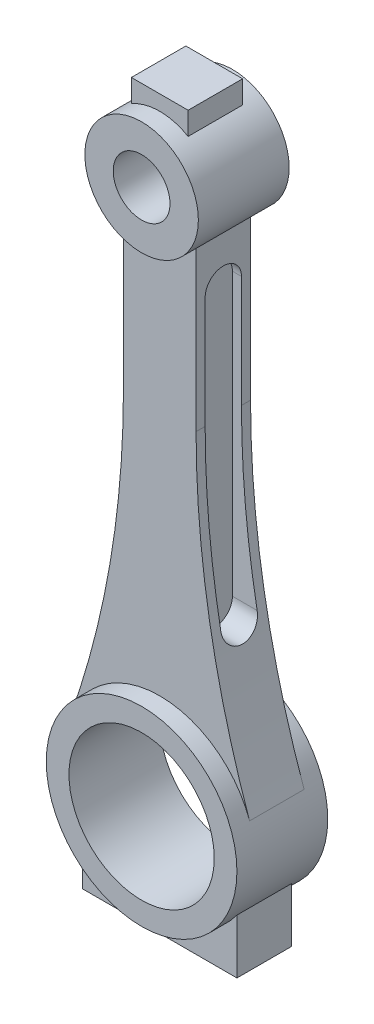
ISO-10303-21;
HEADER;
FILE_DESCRIPTION(('STEP AP214'),'2;1');
FILE_NAME('part.step','',(''),(''),'','','');
FILE_SCHEMA(('AUTOMOTIVE_DESIGN { 1 0 10303 214 1 1 1 1 }'));
ENDSEC;
DATA;
#1=APPLICATION_CONTEXT('core data for automotive mechanical design processes');
#2=APPLICATION_PROTOCOL_DEFINITION('international standard','automotive_design',2000,#1);
#3=PRODUCT_CONTEXT('',#1,'mechanical');
#4=PRODUCT('Part','Part','',(#3));
#5=PRODUCT_RELATED_PRODUCT_CATEGORY('part','',(#4));
#6=PRODUCT_DEFINITION_FORMATION('','',#4);
#7=PRODUCT_DEFINITION_CONTEXT('part definition',#1,'design');
#8=PRODUCT_DEFINITION('design','',#6,#7);
#9=PRODUCT_DEFINITION_SHAPE('','',#8);
#10=(LENGTH_UNIT() NAMED_UNIT(*) SI_UNIT(.MILLI.,.METRE.));
#11=(NAMED_UNIT(*) PLANE_ANGLE_UNIT() SI_UNIT($,.RADIAN.));
#12=(NAMED_UNIT(*) SI_UNIT($,.STERADIAN.) SOLID_ANGLE_UNIT());
#13=UNCERTAINTY_MEASURE_WITH_UNIT(LENGTH_MEASURE(1.E-05),#10,'distance_accuracy_value','');
#14=(GEOMETRIC_REPRESENTATION_CONTEXT(3) GLOBAL_UNCERTAINTY_ASSIGNED_CONTEXT((#13)) GLOBAL_UNIT_ASSIGNED_CONTEXT((#10,
#11,#12)) REPRESENTATION_CONTEXT('',''));
#15=CARTESIAN_POINT('',(0.,0.,0.));
#16=DIRECTION('',(0.,0.,1.));
#17=DIRECTION('',(1.,0.,0.));
#18=AXIS2_PLACEMENT_3D('',#15,#16,#17);
#19=CARTESIAN_POINT('',(212.132819979024,75.3953136438507,6.));
#20=DIRECTION('',(0.,0.,-1.));
#21=DIRECTION('',(-1.,0.,0.));
#22=AXIS2_PLACEMENT_3D('',#19,#20,#21);
#23=CYLINDRICAL_SURFACE('',#22,204.132819979024);
#24=CARTESIAN_POINT('',(11.4544735884215,38.,-4.00000000000001));
#25=CARTESIAN_POINT('',(11.4757515518411,37.8858086335559,-4.00000967356236));
#26=CARTESIAN_POINT('',(11.497127848932,37.7716411229782,-3.9951101211208));
#27=CARTESIAN_POINT('',(11.5399210356049,37.544152772884,-3.97557755361704));
#28=CARTESIAN_POINT('',(11.5613379239584,37.4308319082382,-3.9609448286138));
#29=CARTESIAN_POINT('',(11.6040518019029,37.2058589467753,-3.92203609087538));
#30=CARTESIAN_POINT('',(11.6253488219803,37.0942064124742,-3.89776265395078));
#31=CARTESIAN_POINT('',(11.6676599337569,36.8733657612217,-3.83975872762631));
#32=CARTESIAN_POINT('',(11.6886740293759,36.7641776101131,-3.80602836938937));
#33=CARTESIAN_POINT('',(11.7510730473326,36.4413470108117,-3.69089420326938));
#34=CARTESIAN_POINT('',(11.7918289081029,36.2323636826891,-3.59553432969808));
#35=CARTESIAN_POINT('',(11.8702126062764,35.833491871712,-3.37027556179514));
#36=CARTESIAN_POINT('',(11.9078413597511,35.643597793309,-3.24038682968163));
#37=CARTESIAN_POINT('',(11.9784728244352,35.2894796680367,-2.950436910244));
#38=CARTESIAN_POINT('',(12.0115036519544,35.1250988255321,-2.79057453802655));
#39=CARTESIAN_POINT('',(12.0720036427705,34.8256035029566,-2.44449926104124));
#40=CARTESIAN_POINT('',(12.0994724370193,34.6904909648341,-2.25828460915733));
#41=CARTESIAN_POINT('',(12.1473413477104,34.4559602912754,-1.86832249559897));
#42=CARTESIAN_POINT('',(12.1678582991115,34.3559510460777,-1.66494499104501));
#43=CARTESIAN_POINT('',(12.201667760202,34.1915558050773,-1.24372237948288));
#44=CARTESIAN_POINT('',(12.2149615713728,34.1271633917176,-1.02587988675161));
#45=CARTESIAN_POINT('',(12.2336033492387,34.0369591960168,-0.586274812122707));
#46=CARTESIAN_POINT('',(12.2390950212481,34.0104496060439,-0.364661335561857));
#47=CARTESIAN_POINT('',(12.2423732155318,33.9946184843632,0.0799443502249391));
#48=CARTESIAN_POINT('',(12.2401601145853,34.0052951341723,0.302936491499032));
#49=CARTESIAN_POINT('',(12.2281765408432,34.0632127244266,0.74178192582431));
#50=CARTESIAN_POINT('',(12.2184766498272,34.1101121767816,0.957682365575696));
#51=CARTESIAN_POINT('',(12.1919895794175,34.2385791029979,1.37844153266757));
#52=CARTESIAN_POINT('',(12.1752023313576,34.3201469127454,1.58330015300714));
#53=CARTESIAN_POINT('',(12.1350793834177,34.5159552856904,1.977397761575));
#54=CARTESIAN_POINT('',(12.1117098081663,34.6303649264094,2.16654921549123));
#55=CARTESIAN_POINT('',(12.0593260749273,34.8882465100265,2.52297125984127));
#56=CARTESIAN_POINT('',(12.0303117725959,35.0317191961119,2.69024129055298));
#57=CARTESIAN_POINT('',(11.9671383735568,35.3461665633751,3.00114206510914));
#58=CARTESIAN_POINT('',(11.9329025496515,35.5175545383741,3.14433904981939));
#59=CARTESIAN_POINT('',(11.8607975408037,35.8812712267655,3.40006280722764));
#60=CARTESIAN_POINT('',(11.8229268395298,36.0736086840292,3.51257670427656));
#61=CARTESIAN_POINT('',(11.744011046999,36.4777513253325,3.70593438635491));
#62=CARTESIAN_POINT('',(11.7029182624971,36.6898643551292,3.78611370956408));
#63=CARTESIAN_POINT('',(11.6195357198389,37.1241795414682,3.90944320644274));
#64=CARTESIAN_POINT('',(11.5772477716993,37.3463667203578,3.95264656840454));
#65=CARTESIAN_POINT('',(11.5215540274852,37.6417241762258,3.98457340087694));
#66=CARTESIAN_POINT('',(11.5080944382149,37.713314753212,3.99036111817268));
#67=CARTESIAN_POINT('',(11.4812368188341,37.8565916807733,3.99806924003837));
#68=CARTESIAN_POINT('',(11.467838723541,37.9282776734255,3.99999606757804));
#69=CARTESIAN_POINT('',(11.4544735884215,38.,3.99999999999999));
#70=B_SPLINE_CURVE_WITH_KNOTS('',3,(#24,#25,#26,#27,#28,#29,#30,#31,#32,#33,#34,#35,#36,#37,#38,
#39,#40,#41,#42,#43,#44,#45,#46,#47,#48,#49,#50,#51,#52,#53,#54,#55,#56,#57,#58,#59,#60,#61,#62,
#63,#64,#65,#66,#67,#68,#69),.UNSPECIFIED.,.F.,.F.,(4,2,2,2,2,2,2,2,2,2,2,2,2,2,2,2,2,2,2,2,2,2,
4),(0.,0.348357600629778,0.696704820295753,1.044959030908,1.39320841164154,2.0894785742732,
2.78554404346983,3.47714614167072,4.1687941135383,4.84816302804555,5.52740949173435,
6.19397531687089,6.86050854603355,7.52083364695974,8.18116514562693,8.84495910470898,
9.50877004017901,10.1834922182609,10.8584970981523,11.546741507572,12.2339942357505,
12.4531452672714,12.6719314158043),.UNSPECIFIED.);
#71=CARTESIAN_POINT('',(11.4544735884215,38.,-4.00000000000001));
#72=VERTEX_POINT('',#71);
#73=CARTESIAN_POINT('',(11.4544735884215,38.,3.99999999999999));
#74=VERTEX_POINT('',#73);
#75=EDGE_CURVE('E400',#72,#74,#70,.T.);
#76=ORIENTED_EDGE('',*,*,#75,.T.);
#77=CARTESIAN_POINT('',(212.132819979024,75.3953136438507,4.));
#78=DIRECTION('',(0.,0.,-1.));
#79=DIRECTION('',(0.,1.,0.));
#80=AXIS2_PLACEMENT_3D('',#77,#78,#79);
#81=CIRCLE('',#80,204.132819979024);
#82=CARTESIAN_POINT('',(8.,75.3953136438507,4.));
#83=VERTEX_POINT('',#82);
#84=EDGE_CURVE('E251',#74,#83,#81,.T.);
#85=ORIENTED_EDGE('',*,*,#84,.T.);
#86=DIRECTION('',(0.,0.,-1.));
#87=VECTOR('',#86,1.);
#88=CARTESIAN_POINT('',(8.,75.3953136438507,6.));
#89=LINE('',#88,#87);
#90=CARTESIAN_POINT('',(8.,75.3953136438507,6.));
#91=VERTEX_POINT('',#90);
#92=EDGE_CURVE('E367',#91,#83,#89,.T.);
#93=ORIENTED_EDGE('',*,*,#92,.F.);
#94=CARTESIAN_POINT('',(212.132819979024,75.3953136438507,6.));
#95=DIRECTION('',(0.,0.,1.));
#96=DIRECTION('',(1.,0.,0.));
#97=AXIS2_PLACEMENT_3D('',#94,#95,#96);
#98=CIRCLE('',#97,204.132819979024);
#99=CARTESIAN_POINT('',(19.7873824881444,7.03274443356765,6.));
#100=VERTEX_POINT('',#99);
#101=EDGE_CURVE('E342',#91,#100,#98,.T.);
#102=ORIENTED_EDGE('',*,*,#101,.T.);
#103=DIRECTION('',(0.,0.,-1.));
#104=VECTOR('',#103,1.);
#105=CARTESIAN_POINT('',(19.7873824881444,7.03274443356764,6.));
#106=LINE('',#105,#104);
#107=CARTESIAN_POINT('',(19.7873824881444,7.03274443356765,-6.));
#108=VERTEX_POINT('',#107);
#109=EDGE_CURVE('E370',#100,#108,#106,.T.);
#110=ORIENTED_EDGE('',*,*,#109,.T.);
#111=CARTESIAN_POINT('',(212.132819979024,75.3953136438507,-6.));
#112=DIRECTION('',(0.,0.,1.));
#113=DIRECTION('',(1.,0.,0.));
#114=AXIS2_PLACEMENT_3D('',#111,#112,#113);
#115=CIRCLE('',#114,204.132819979024);
#116=CARTESIAN_POINT('',(8.,75.3953136438507,-6.));
#117=VERTEX_POINT('',#116);
#118=EDGE_CURVE('E360',#117,#108,#115,.T.);
#119=ORIENTED_EDGE('',*,*,#118,.F.);
#120=CARTESIAN_POINT('',(8.,75.3953136438507,-4.));
#121=VERTEX_POINT('',#120);
#122=EDGE_CURVE('E366',#121,#117,#89,.T.);
#123=ORIENTED_EDGE('',*,*,#122,.F.);
#124=CARTESIAN_POINT('',(212.132819979024,75.3953136438507,-4.00000000000001));
#125=DIRECTION('',(0.,0.,1.));
#126=DIRECTION('',(0.,-1.,0.));
#127=AXIS2_PLACEMENT_3D('',#124,#125,#126);
#128=CIRCLE('',#127,204.132819979024);
#129=EDGE_CURVE('E58',#121,#72,#128,.T.);
#130=ORIENTED_EDGE('',*,*,#129,.T.);
#131=EDGE_LOOP('',(#76,#85,#93,#102,#110,#119,#123,#130));
#132=FACE_BOUND('',#131,.T.);
#133=ADVANCED_FACE('F35',(#132),#23,.F.);
#134=CARTESIAN_POINT('',(8.00000000000001,0.,6.));
#135=DIRECTION('',(-1.,0.,0.));
#136=DIRECTION('',(0.,-1.,0.));
#137=AXIS2_PLACEMENT_3D('',#134,#135,#136);
#138=PLANE('',#137);
#139=DIRECTION('',(0.,-1.,0.));
#140=VECTOR('',#139,1.);
#141=CARTESIAN_POINT('',(8.00000000000001,0.,3.99999999999999));
#142=LINE('',#141,#140);
#143=CARTESIAN_POINT('',(8.00000000000001,100.,4.));
#144=VERTEX_POINT('',#143);
#145=EDGE_CURVE('E398',#144,#83,#142,.T.);
#146=ORIENTED_EDGE('',*,*,#145,.F.);
#147=CARTESIAN_POINT('',(8.,100.,0.));
#148=DIRECTION('',(-1.,0.,0.));
#149=DIRECTION('',(0.,-1.,0.));
#150=AXIS2_PLACEMENT_3D('',#147,#148,#149);
#151=CIRCLE('',#150,4.);
#152=CARTESIAN_POINT('',(8.00000000000001,100.,-4.));
#153=VERTEX_POINT('',#152);
#154=EDGE_CURVE('E396',#153,#144,#151,.F.);
#155=ORIENTED_EDGE('',*,*,#154,.F.);
#156=DIRECTION('',(0.,1.,0.));
#157=VECTOR('',#156,1.);
#158=CARTESIAN_POINT('',(8.00000000000001,0.,-4.00000000000001));
#159=LINE('',#158,#157);
#160=EDGE_CURVE('E390',#121,#153,#159,.T.);
#161=ORIENTED_EDGE('',*,*,#160,.F.);
#162=ORIENTED_EDGE('',*,*,#122,.T.);
#163=DIRECTION('',(0.,1.,0.));
#164=VECTOR('',#163,1.);
#165=CARTESIAN_POINT('',(8.00000000000001,0.,-6.));
#166=LINE('',#165,#164);
#167=CARTESIAN_POINT('',(8.,110.395313643851,-6.));
#168=VERTEX_POINT('',#167);
#169=EDGE_CURVE('E335',#117,#168,#166,.T.);
#170=ORIENTED_EDGE('',*,*,#169,.T.);
#171=DIRECTION('',(0.,0.,-1.));
#172=VECTOR('',#171,1.);
#173=CARTESIAN_POINT('',(8.,110.395313643851,6.));
#174=LINE('',#173,#172);
#175=CARTESIAN_POINT('',(8.,110.395313643851,6.));
#176=VERTEX_POINT('',#175);
#177=EDGE_CURVE('E348',#176,#168,#174,.T.);
#178=ORIENTED_EDGE('',*,*,#177,.F.);
#179=DIRECTION('',(0.,1.,0.));
#180=VECTOR('',#179,1.);
#181=CARTESIAN_POINT('',(8.00000000000001,0.,6.));
#182=LINE('',#181,#180);
#183=EDGE_CURVE('E345',#91,#176,#182,.T.);
#184=ORIENTED_EDGE('',*,*,#183,.F.);
#185=ORIENTED_EDGE('',*,*,#92,.T.);
#186=EDGE_LOOP('',(#146,#155,#161,#162,#170,#178,#184,#185));
#187=FACE_BOUND('',#186,.T.);
#188=ADVANCED_FACE('F493',(#187),#138,.F.);
#189=CARTESIAN_POINT('',(0.,0.,10.));
#190=DIRECTION('',(0.,0.,-1.));
#191=DIRECTION('',(-1.,0.,0.));
#192=AXIS2_PLACEMENT_3D('',#189,#190,#191);
#193=CYLINDRICAL_SURFACE('',#192,16.);
#194=CARTESIAN_POINT('',(0.,0.,10.));
#195=DIRECTION('',(0.,0.,1.));
#196=DIRECTION('',(1.,0.,0.));
#197=AXIS2_PLACEMENT_3D('',#194,#195,#196);
#198=CIRCLE('',#197,16.);
#199=CARTESIAN_POINT('',(16.,0.,10.));
#200=VERTEX_POINT('',#199);
#201=EDGE_CURVE('E383',#200,#200,#198,.T.);
#202=ORIENTED_EDGE('',*,*,#201,.T.);
#203=EDGE_LOOP('',(#202));
#204=FACE_BOUND('',#203,.T.);
#205=CARTESIAN_POINT('',(0.,0.,-10.));
#206=DIRECTION('',(0.,0.,1.));
#207=DIRECTION('',(1.,0.,0.));
#208=AXIS2_PLACEMENT_3D('',#205,#206,#207);
#209=CIRCLE('',#208,16.);
#210=CARTESIAN_POINT('',(16.,0.,-10.));
#211=VERTEX_POINT('',#210);
#212=EDGE_CURVE('E382',#211,#211,#209,.T.);
#213=ORIENTED_EDGE('',*,*,#212,.F.);
#214=EDGE_LOOP('',(#213));
#215=FACE_BOUND('',#214,.T.);
#216=ADVANCED_FACE('F37',(#204,#215),#193,.F.);
#217=CARTESIAN_POINT('',(0.,0.,10.));
#218=DIRECTION('',(0.,0.,-1.));
#219=DIRECTION('',(-1.,0.,0.));
#220=AXIS2_PLACEMENT_3D('',#217,#218,#219);
#221=CYLINDRICAL_SURFACE('',#220,21.);
#222=DIRECTION('',(0.,0.,-1.));
#223=VECTOR('',#222,1.);
#224=CARTESIAN_POINT('',(-17.,-12.328828005938,6.));
#225=LINE('',#224,#223);
#226=CARTESIAN_POINT('',(-17.,-12.328828005938,6.));
#227=VERTEX_POINT('',#226);
#228=CARTESIAN_POINT('',(-17.,-12.328828005938,-6.));
#229=VERTEX_POINT('',#228);
#230=EDGE_CURVE('E279',#227,#229,#225,.T.);
#231=ORIENTED_EDGE('',*,*,#230,.F.);
#232=CARTESIAN_POINT('',(0.,0.,6.));
#233=DIRECTION('',(0.,0.,1.));
#234=DIRECTION('',(1.,0.,0.));
#235=AXIS2_PLACEMENT_3D('',#232,#233,#234);
#236=CIRCLE('',#235,21.);
#237=CARTESIAN_POINT('',(17.,-12.3288280059379,6.));
#238=VERTEX_POINT('',#237);
#239=EDGE_CURVE('E262',#227,#238,#236,.T.);
#240=ORIENTED_EDGE('',*,*,#239,.T.);
#241=DIRECTION('',(0.,0.,-1.));
#242=VECTOR('',#241,1.);
#243=CARTESIAN_POINT('',(17.,-12.328828005938,6.));
#244=LINE('',#243,#242);
#245=CARTESIAN_POINT('',(17.,-12.328828005938,-6.));
#246=VERTEX_POINT('',#245);
#247=EDGE_CURVE('E282',#238,#246,#244,.T.);
#248=ORIENTED_EDGE('',*,*,#247,.T.);
#249=CARTESIAN_POINT('',(0.,0.,-6.));
#250=DIRECTION('',(0.,0.,1.));
#251=DIRECTION('',(1.,0.,0.));
#252=AXIS2_PLACEMENT_3D('',#249,#250,#251);
#253=CIRCLE('',#252,21.);
#254=EDGE_CURVE('E273',#229,#246,#253,.T.);
#255=ORIENTED_EDGE('',*,*,#254,.F.);
#256=EDGE_LOOP('',(#231,#240,#248,#255));
#257=FACE_BOUND('',#256,.T.);
#258=ORIENTED_EDGE('',*,*,#109,.F.);
#259=CARTESIAN_POINT('',(0.,0.,6.));
#260=DIRECTION('',(0.,0.,1.));
#261=DIRECTION('',(1.,0.,0.));
#262=AXIS2_PLACEMENT_3D('',#259,#260,#261);
#263=CIRCLE('',#262,21.);
#264=CARTESIAN_POINT('',(-19.7873824881444,7.03274443356765,6.));
#265=VERTEX_POINT('',#264);
#266=EDGE_CURVE('E340',#100,#265,#263,.T.);
#267=ORIENTED_EDGE('',*,*,#266,.T.);
#268=DIRECTION('',(0.,0.,-1.));
#269=VECTOR('',#268,1.);
#270=CARTESIAN_POINT('',(-19.7873824881444,7.03274443356764,6.));
#271=LINE('',#270,#269);
#272=CARTESIAN_POINT('',(-19.7873824881444,7.03274443356764,-6.));
#273=VERTEX_POINT('',#272);
#274=EDGE_CURVE('E373',#265,#273,#271,.T.);
#275=ORIENTED_EDGE('',*,*,#274,.T.);
#276=CARTESIAN_POINT('',(0.,0.,-6.));
#277=DIRECTION('',(0.,0.,1.));
#278=DIRECTION('',(1.,0.,0.));
#279=AXIS2_PLACEMENT_3D('',#276,#277,#278);
#280=CIRCLE('',#279,21.);
#281=EDGE_CURVE('E357',#108,#273,#280,.T.);
#282=ORIENTED_EDGE('',*,*,#281,.F.);
#283=EDGE_LOOP('',(#258,#267,#275,#282));
#284=FACE_BOUND('',#283,.T.);
#285=CARTESIAN_POINT('',(0.,0.,10.));
#286=DIRECTION('',(0.,0.,1.));
#287=DIRECTION('',(1.,0.,0.));
#288=AXIS2_PLACEMENT_3D('',#285,#286,#287);
#289=CIRCLE('',#288,21.);
#290=CARTESIAN_POINT('',(21.,0.,10.));
#291=VERTEX_POINT('',#290);
#292=EDGE_CURVE('E386',#291,#291,#289,.T.);
#293=ORIENTED_EDGE('',*,*,#292,.F.);
#294=EDGE_LOOP('',(#293));
#295=FACE_BOUND('',#294,.T.);
#296=CARTESIAN_POINT('',(0.,0.,-10.));
#297=DIRECTION('',(0.,0.,1.));
#298=DIRECTION('',(1.,0.,0.));
#299=AXIS2_PLACEMENT_3D('',#296,#297,#298);
#300=CIRCLE('',#299,21.);
#301=CARTESIAN_POINT('',(21.,0.,-10.));
#302=VERTEX_POINT('',#301);
#303=EDGE_CURVE('E387',#302,#302,#300,.T.);
#304=ORIENTED_EDGE('',*,*,#303,.T.);
#305=EDGE_LOOP('',(#304));
#306=FACE_BOUND('',#305,.T.);
#307=ADVANCED_FACE('F500',(#257,#284,#295,#306),#221,.T.);
#308=CARTESIAN_POINT('',(0.,0.,10.));
#309=DIRECTION('',(0.,0.,1.));
#310=DIRECTION('',(1.,0.,0.));
#311=AXIS2_PLACEMENT_3D('',#308,#309,#310);
#312=PLANE('',#311);
#313=ORIENTED_EDGE('',*,*,#201,.F.);
#314=EDGE_LOOP('',(#313));
#315=FACE_BOUND('',#314,.T.);
#316=ORIENTED_EDGE('',*,*,#292,.T.);
#317=EDGE_LOOP('',(#316));
#318=FACE_BOUND('',#317,.T.);
#319=ADVANCED_FACE('F546',(#315,#318),#312,.T.);
#320=CARTESIAN_POINT('',(0.,0.,-10.));
#321=DIRECTION('',(0.,0.,1.));
#322=DIRECTION('',(1.,0.,0.));
#323=AXIS2_PLACEMENT_3D('',#320,#321,#322);
#324=PLANE('',#323);
#325=ORIENTED_EDGE('',*,*,#212,.T.);
#326=EDGE_LOOP('',(#325));
#327=FACE_BOUND('',#326,.T.);
#328=ORIENTED_EDGE('',*,*,#303,.F.);
#329=EDGE_LOOP('',(#328));
#330=FACE_BOUND('',#329,.T.);
#331=ADVANCED_FACE('F544',(#327,#330),#324,.F.);
#332=CARTESIAN_POINT('',(-7.99999999999998,0.,6.));
#333=DIRECTION('',(1.,0.,0.));
#334=DIRECTION('',(0.,1.,0.));
#335=AXIS2_PLACEMENT_3D('',#332,#333,#334);
#336=PLANE('',#335);
#337=DIRECTION('',(0.,0.,-1.));
#338=VECTOR('',#337,1.);
#339=CARTESIAN_POINT('',(-7.99999999999999,75.3953136438507,6.));
#340=LINE('',#339,#338);
#341=CARTESIAN_POINT('',(-8.00000000000001,75.3953136438507,-4.00000000000001));
#342=VERTEX_POINT('',#341);
#343=CARTESIAN_POINT('',(-7.99999999999999,75.3953136438507,-6.));
#344=VERTEX_POINT('',#343);
#345=EDGE_CURVE('E375',#342,#344,#340,.T.);
#346=ORIENTED_EDGE('',*,*,#345,.F.);
#347=DIRECTION('',(0.,1.,0.));
#348=VECTOR('',#347,1.);
#349=CARTESIAN_POINT('',(-7.99999999999998,0.,-4.00000000000001));
#350=LINE('',#349,#348);
#351=CARTESIAN_POINT('',(-8.,100.,-4.));
#352=VERTEX_POINT('',#351);
#353=EDGE_CURVE('E227',#342,#352,#350,.T.);
#354=ORIENTED_EDGE('',*,*,#353,.T.);
#355=CARTESIAN_POINT('',(-8.,100.,0.));
#356=DIRECTION('',(1.,0.,0.));
#357=DIRECTION('',(0.,1.,0.));
#358=AXIS2_PLACEMENT_3D('',#355,#356,#357);
#359=CIRCLE('',#358,4.);
#360=CARTESIAN_POINT('',(-8.,100.,4.));
#361=VERTEX_POINT('',#360);
#362=EDGE_CURVE('E11',#352,#361,#359,.T.);
#363=ORIENTED_EDGE('',*,*,#362,.T.);
#364=DIRECTION('',(0.,-1.,0.));
#365=VECTOR('',#364,1.);
#366=CARTESIAN_POINT('',(-7.99999999999998,0.,3.99999999999999));
#367=LINE('',#366,#365);
#368=CARTESIAN_POINT('',(-8.00000000000001,75.3953136438507,4.));
#369=VERTEX_POINT('',#368);
#370=EDGE_CURVE('E200',#361,#369,#367,.T.);
#371=ORIENTED_EDGE('',*,*,#370,.T.);
#372=CARTESIAN_POINT('',(-7.99999999999999,75.3953136438507,6.));
#373=VERTEX_POINT('',#372);
#374=EDGE_CURVE('E376',#373,#369,#340,.T.);
#375=ORIENTED_EDGE('',*,*,#374,.F.);
#376=DIRECTION('',(0.,-1.,0.));
#377=VECTOR('',#376,1.);
#378=CARTESIAN_POINT('',(-7.99999999999998,0.,6.));
#379=LINE('',#378,#377);
#380=CARTESIAN_POINT('',(-8.,110.395313643851,6.));
#381=VERTEX_POINT('',#380);
#382=EDGE_CURVE('E334',#381,#373,#379,.T.);
#383=ORIENTED_EDGE('',*,*,#382,.F.);
#384=DIRECTION('',(0.,0.,-1.));
#385=VECTOR('',#384,1.);
#386=CARTESIAN_POINT('',(-8.,110.395313643851,6.));
#387=LINE('',#386,#385);
#388=CARTESIAN_POINT('',(-8.,110.395313643851,-6.));
#389=VERTEX_POINT('',#388);
#390=EDGE_CURVE('E379',#381,#389,#387,.T.);
#391=ORIENTED_EDGE('',*,*,#390,.T.);
#392=DIRECTION('',(0.,-1.,0.));
#393=VECTOR('',#392,1.);
#394=CARTESIAN_POINT('',(-7.99999999999998,0.,-6.));
#395=LINE('',#394,#393);
#396=EDGE_CURVE('E351',#389,#344,#395,.T.);
#397=ORIENTED_EDGE('',*,*,#396,.T.);
#398=EDGE_LOOP('',(#346,#354,#363,#371,#375,#383,#391,#397));
#399=FACE_BOUND('',#398,.T.);
#400=ADVANCED_FACE('F540',(#399),#336,.F.);
#401=CARTESIAN_POINT('',(-212.132819979024,75.3953136438507,6.));
#402=DIRECTION('',(0.,0.,-1.));
#403=DIRECTION('',(-1.,0.,0.));
#404=AXIS2_PLACEMENT_3D('',#401,#402,#403);
#405=CYLINDRICAL_SURFACE('',#404,204.132819979024);
#406=CARTESIAN_POINT('',(-11.4544735884215,38.,3.99999999999999));
#407=CARTESIAN_POINT('',(-11.4757515518411,37.8858086335559,4.00000967356234));
#408=CARTESIAN_POINT('',(-11.497127848932,37.7716411229782,3.99511012112078));
#409=CARTESIAN_POINT('',(-11.5399210356049,37.544152772884,3.97557755361703));
#410=CARTESIAN_POINT('',(-11.5613379239584,37.4308319082382,3.96094482861378));
#411=CARTESIAN_POINT('',(-11.6040518019029,37.2058589467753,3.92203609087536));
#412=CARTESIAN_POINT('',(-11.6253488219803,37.0942064124742,3.89776265395076));
#413=CARTESIAN_POINT('',(-11.6676599337569,36.8733657612217,3.83975872762629));
#414=CARTESIAN_POINT('',(-11.6886740293759,36.7641776101131,3.80602836938935));
#415=CARTESIAN_POINT('',(-11.7510730473326,36.4413470108117,3.69089420326937));
#416=CARTESIAN_POINT('',(-11.7918289081029,36.2323636826891,3.59553432969806));
#417=CARTESIAN_POINT('',(-11.8702126062764,35.833491871712,3.37027556179512));
#418=CARTESIAN_POINT('',(-11.9078413597511,35.643597793309,3.24038682968161));
#419=CARTESIAN_POINT('',(-11.9784728244352,35.2894796680367,2.95043691024399));
#420=CARTESIAN_POINT('',(-12.0115036519544,35.1250988255321,2.79057453802654));
#421=CARTESIAN_POINT('',(-12.0720036427705,34.8256035029566,2.44449926104122));
#422=CARTESIAN_POINT('',(-12.0994724370193,34.6904909648341,2.25828460915732));
#423=CARTESIAN_POINT('',(-12.1473413477104,34.4559602912754,1.86832249559895));
#424=CARTESIAN_POINT('',(-12.1678582991115,34.3559510460777,1.66494499104499));
#425=CARTESIAN_POINT('',(-12.201667760202,34.1915558050773,1.24372237948286));
#426=CARTESIAN_POINT('',(-12.2149615713728,34.1271633917176,1.02587988675159));
#427=CARTESIAN_POINT('',(-12.2336033492387,34.0369591960168,0.58627481212269));
#428=CARTESIAN_POINT('',(-12.2390950212481,34.0104496060439,0.36466133556184));
#429=CARTESIAN_POINT('',(-12.2423732155318,33.9946184843632,-0.0799443502249565));
#430=CARTESIAN_POINT('',(-12.2401601145853,34.0052951341723,-0.30293649149905));
#431=CARTESIAN_POINT('',(-12.2281765408432,34.0632127244266,-0.741781925824328));
#432=CARTESIAN_POINT('',(-12.2184766498272,34.1101121767816,-0.957682365575713));
#433=CARTESIAN_POINT('',(-12.1919895794175,34.2385791029979,-1.37844153266759));
#434=CARTESIAN_POINT('',(-12.1752023313576,34.3201469127454,-1.58330015300716));
#435=CARTESIAN_POINT('',(-12.1350793834177,34.5159552856904,-1.97739776157502));
#436=CARTESIAN_POINT('',(-12.1117098081663,34.6303649264094,-2.16654921549125));
#437=CARTESIAN_POINT('',(-12.0593260749273,34.8882465100265,-2.52297125984129));
#438=CARTESIAN_POINT('',(-12.0303117725959,35.0317191961119,-2.690241290553));
#439=CARTESIAN_POINT('',(-11.9671383735568,35.3461665633751,-3.00114206510916));
#440=CARTESIAN_POINT('',(-11.9329025496515,35.5175545383741,-3.1443390498194));
#441=CARTESIAN_POINT('',(-11.8607975408037,35.8812712267655,-3.40006280722766));
#442=CARTESIAN_POINT('',(-11.8229268395298,36.0736086840292,-3.51257670427658));
#443=CARTESIAN_POINT('',(-11.744011046999,36.4777513253325,-3.70593438635493));
#444=CARTESIAN_POINT('',(-11.7029182624971,36.6898643551292,-3.78611370956409));
#445=CARTESIAN_POINT('',(-11.6195357198389,37.1241795414682,-3.90944320644275));
#446=CARTESIAN_POINT('',(-11.5772477716993,37.3463667203578,-3.95264656840456));
#447=CARTESIAN_POINT('',(-11.5215540274853,37.6417241762258,-3.98457340087695));
#448=CARTESIAN_POINT('',(-11.5080944382149,37.713314753212,-3.9903611181727));
#449=CARTESIAN_POINT('',(-11.4812368188341,37.8565916807733,-3.99806924003838));
#450=CARTESIAN_POINT('',(-11.467838723541,37.9282776734255,-3.99999606757806));
#451=CARTESIAN_POINT('',(-11.4544735884215,38.,-4.00000000000001));
#452=B_SPLINE_CURVE_WITH_KNOTS('',3,(#406,#407,#408,#409,#410,#411,#412,#413,#414,#415,#416,
#417,#418,#419,#420,#421,#422,#423,#424,#425,#426,#427,#428,#429,#430,#431,#432,#433,#434,#435,
#436,#437,#438,#439,#440,#441,#442,#443,#444,#445,#446,#447,#448,#449,#450,#451),.UNSPECIFIED.,
.F.,.F.,(4,2,2,2,2,2,2,2,2,2,2,2,2,2,2,2,2,2,2,2,2,2,4),(0.,0.348357600629778,0.696704820295753,
1.044959030908,1.39320841164154,2.0894785742732,2.78554404346983,3.47714614167072,
4.1687941135383,4.84816302804555,5.52740949173435,6.19397531687089,6.86050854603355,
7.52083364695974,8.18116514562693,8.84495910470898,9.50877004017901,10.1834922182609,
10.8584970981523,11.546741507572,12.2339942357505,12.4531452672714,12.6719314158043),.UNSPECIFIED.);
#453=CARTESIAN_POINT('',(-11.4544735884215,38.,3.99999999999999));
#454=VERTEX_POINT('',#453);
#455=CARTESIAN_POINT('',(-11.4544735884215,38.,-4.00000000000001));
#456=VERTEX_POINT('',#455);
#457=EDGE_CURVE('E532',#454,#456,#452,.T.);
#458=ORIENTED_EDGE('',*,*,#457,.T.);
#459=CARTESIAN_POINT('',(-212.132819979024,75.3953136438507,-4.00000000000001));
#460=DIRECTION('',(0.,0.,-1.));
#461=DIRECTION('',(0.,1.,0.));
#462=AXIS2_PLACEMENT_3D('',#459,#460,#461);
#463=CIRCLE('',#462,204.132819979024);
#464=EDGE_CURVE('E43',#456,#342,#463,.F.);
#465=ORIENTED_EDGE('',*,*,#464,.T.);
#466=ORIENTED_EDGE('',*,*,#345,.T.);
#467=CARTESIAN_POINT('',(-212.132819979024,75.3953136438507,-6.));
#468=DIRECTION('',(0.,0.,1.));
#469=DIRECTION('',(1.,0.,0.));
#470=AXIS2_PLACEMENT_3D('',#467,#468,#469);
#471=CIRCLE('',#470,204.132819979024);
#472=EDGE_CURVE('E354',#344,#273,#471,.F.);
#473=ORIENTED_EDGE('',*,*,#472,.T.);
#474=ORIENTED_EDGE('',*,*,#274,.F.);
#475=CARTESIAN_POINT('',(-212.132819979024,75.3953136438507,6.));
#476=DIRECTION('',(0.,0.,1.));
#477=DIRECTION('',(1.,0.,0.));
#478=AXIS2_PLACEMENT_3D('',#475,#476,#477);
#479=CIRCLE('',#478,204.132819979024);
#480=EDGE_CURVE('E337',#373,#265,#479,.F.);
#481=ORIENTED_EDGE('',*,*,#480,.F.);
#482=ORIENTED_EDGE('',*,*,#374,.T.);
#483=CARTESIAN_POINT('',(-212.132819979024,75.3953136438507,4.));
#484=DIRECTION('',(0.,0.,1.));
#485=DIRECTION('',(0.,-1.,0.));
#486=AXIS2_PLACEMENT_3D('',#483,#484,#485);
#487=CIRCLE('',#486,204.132819979024);
#488=EDGE_CURVE('E408',#369,#454,#487,.F.);
#489=ORIENTED_EDGE('',*,*,#488,.T.);
#490=EDGE_LOOP('',(#458,#465,#466,#473,#474,#481,#482,#489));
#491=FACE_BOUND('',#490,.T.);
#492=ADVANCED_FACE('F489',(#491),#405,.F.);
#493=CARTESIAN_POINT('',(0.,0.,6.));
#494=DIRECTION('',(0.,0.,1.));
#495=DIRECTION('',(1.,0.,0.));
#496=AXIS2_PLACEMENT_3D('',#493,#494,#495);
#497=PLANE('',#496);
#498=CARTESIAN_POINT('',(0.,120.,6.));
#499=DIRECTION('',(0.,0.,1.));
#500=DIRECTION('',(1.,0.,0.));
#501=AXIS2_PLACEMENT_3D('',#498,#499,#500);
#502=CIRCLE('',#501,12.5);
#503=EDGE_CURVE('E332',#381,#176,#502,.T.);
#504=ORIENTED_EDGE('',*,*,#503,.F.);
#505=ORIENTED_EDGE('',*,*,#382,.T.);
#506=ORIENTED_EDGE('',*,*,#480,.T.);
#507=ORIENTED_EDGE('',*,*,#266,.F.);
#508=ORIENTED_EDGE('',*,*,#101,.F.);
#509=ORIENTED_EDGE('',*,*,#183,.T.);
#510=EDGE_LOOP('',(#504,#505,#506,#507,#508,#509));
#511=FACE_BOUND('',#510,.T.);
#512=ADVANCED_FACE('F486',(#511),#497,.T.);
#513=CARTESIAN_POINT('',(0.,0.,-6.));
#514=DIRECTION('',(0.,0.,1.));
#515=DIRECTION('',(1.,0.,0.));
#516=AXIS2_PLACEMENT_3D('',#513,#514,#515);
#517=PLANE('',#516);
#518=CARTESIAN_POINT('',(0.,120.,-6.));
#519=DIRECTION('',(0.,0.,1.));
#520=DIRECTION('',(1.,0.,0.));
#521=AXIS2_PLACEMENT_3D('',#518,#519,#520);
#522=CIRCLE('',#521,12.5);
#523=EDGE_CURVE('E327',#389,#168,#522,.T.);
#524=ORIENTED_EDGE('',*,*,#523,.T.);
#525=ORIENTED_EDGE('',*,*,#169,.F.);
#526=ORIENTED_EDGE('',*,*,#118,.T.);
#527=ORIENTED_EDGE('',*,*,#281,.T.);
#528=ORIENTED_EDGE('',*,*,#472,.F.);
#529=ORIENTED_EDGE('',*,*,#396,.F.);
#530=EDGE_LOOP('',(#524,#525,#526,#527,#528,#529));
#531=FACE_BOUND('',#530,.T.);
#532=ADVANCED_FACE('F484',(#531),#517,.F.);
#533=CARTESIAN_POINT('',(0.,120.,10.));
#534=DIRECTION('',(0.,0.,-1.));
#535=DIRECTION('',(-1.,0.,0.));
#536=AXIS2_PLACEMENT_3D('',#533,#534,#535);
#537=CYLINDRICAL_SURFACE('',#536,12.5);
#538=DIRECTION('',(0.,0.,-1.));
#539=VECTOR('',#538,1.);
#540=CARTESIAN_POINT('',(6.25,130.825317547305,6.));
#541=LINE('',#540,#539);
#542=CARTESIAN_POINT('',(6.25,130.825317547305,6.));
#543=VERTEX_POINT('',#542);
#544=CARTESIAN_POINT('',(6.25,130.825317547305,-6.));
#545=VERTEX_POINT('',#544);
#546=EDGE_CURVE('E316',#543,#545,#541,.T.);
#547=ORIENTED_EDGE('',*,*,#546,.F.);
#548=CARTESIAN_POINT('',(0.,120.,6.));
#549=DIRECTION('',(0.,0.,1.));
#550=DIRECTION('',(1.,0.,0.));
#551=AXIS2_PLACEMENT_3D('',#548,#549,#550);
#552=CIRCLE('',#551,12.5);
#553=CARTESIAN_POINT('',(-6.25,130.825317547305,6.));
#554=VERTEX_POINT('',#553);
#555=EDGE_CURVE('E288',#543,#554,#552,.T.);
#556=ORIENTED_EDGE('',*,*,#555,.T.);
#557=DIRECTION('',(0.,0.,-1.));
#558=VECTOR('',#557,1.);
#559=CARTESIAN_POINT('',(-6.25,130.825317547305,6.));
#560=LINE('',#559,#558);
#561=CARTESIAN_POINT('',(-6.25,130.825317547305,-6.));
#562=VERTEX_POINT('',#561);
#563=EDGE_CURVE('E300',#554,#562,#560,.T.);
#564=ORIENTED_EDGE('',*,*,#563,.T.);
#565=CARTESIAN_POINT('',(0.,120.,-6.));
#566=DIRECTION('',(0.,0.,1.));
#567=DIRECTION('',(1.,0.,0.));
#568=AXIS2_PLACEMENT_3D('',#565,#566,#567);
#569=CIRCLE('',#568,12.5);
#570=EDGE_CURVE('E287',#545,#562,#569,.T.);
#571=ORIENTED_EDGE('',*,*,#570,.F.);
#572=EDGE_LOOP('',(#547,#556,#564,#571));
#573=FACE_BOUND('',#572,.T.);
#574=ORIENTED_EDGE('',*,*,#503,.T.);
#575=ORIENTED_EDGE('',*,*,#177,.T.);
#576=ORIENTED_EDGE('',*,*,#523,.F.);
#577=ORIENTED_EDGE('',*,*,#390,.F.);
#578=EDGE_LOOP('',(#574,#575,#576,#577));
#579=FACE_BOUND('',#578,.T.);
#580=CARTESIAN_POINT('',(0.,120.,10.));
#581=DIRECTION('',(0.,0.,1.));
#582=DIRECTION('',(1.,0.,0.));
#583=AXIS2_PLACEMENT_3D('',#580,#581,#582);
#584=CIRCLE('',#583,12.5);
#585=CARTESIAN_POINT('',(12.5,120.,10.));
#586=VERTEX_POINT('',#585);
#587=EDGE_CURVE('E320',#586,#586,#584,.T.);
#588=ORIENTED_EDGE('',*,*,#587,.F.);
#589=EDGE_LOOP('',(#588));
#590=FACE_BOUND('',#589,.T.);
#591=CARTESIAN_POINT('',(0.,120.,-10.));
#592=DIRECTION('',(0.,0.,1.));
#593=DIRECTION('',(1.,0.,0.));
#594=AXIS2_PLACEMENT_3D('',#591,#592,#593);
#595=CIRCLE('',#594,12.5);
#596=CARTESIAN_POINT('',(12.5,120.,-10.));
#597=VERTEX_POINT('',#596);
#598=EDGE_CURVE('E319',#597,#597,#595,.T.);
#599=ORIENTED_EDGE('',*,*,#598,.T.);
#600=EDGE_LOOP('',(#599));
#601=FACE_BOUND('',#600,.T.);
#602=ADVANCED_FACE('F480',(#573,#579,#590,#601),#537,.T.);
#603=CARTESIAN_POINT('',(0.,120.,10.));
#604=DIRECTION('',(0.,0.,-1.));
#605=DIRECTION('',(-1.,0.,0.));
#606=AXIS2_PLACEMENT_3D('',#603,#604,#605);
#607=CYLINDRICAL_SURFACE('',#606,6.25);
#608=CARTESIAN_POINT('',(0.,120.,10.));
#609=DIRECTION('',(0.,0.,1.));
#610=DIRECTION('',(1.,0.,0.));
#611=AXIS2_PLACEMENT_3D('',#608,#609,#610);
#612=CIRCLE('',#611,6.25);
#613=CARTESIAN_POINT('',(6.25,120.,10.));
#614=VERTEX_POINT('',#613);
#615=EDGE_CURVE('E323',#614,#614,#612,.T.);
#616=ORIENTED_EDGE('',*,*,#615,.T.);
#617=EDGE_LOOP('',(#616));
#618=FACE_BOUND('',#617,.T.);
#619=CARTESIAN_POINT('',(0.,120.,-10.));
#620=DIRECTION('',(0.,0.,1.));
#621=DIRECTION('',(1.,0.,0.));
#622=AXIS2_PLACEMENT_3D('',#619,#620,#621);
#623=CIRCLE('',#622,6.25);
#624=CARTESIAN_POINT('',(6.25,120.,-10.));
#625=VERTEX_POINT('',#624);
#626=EDGE_CURVE('E324',#625,#625,#623,.T.);
#627=ORIENTED_EDGE('',*,*,#626,.F.);
#628=EDGE_LOOP('',(#627));
#629=FACE_BOUND('',#628,.T.);
#630=ADVANCED_FACE('F473',(#618,#629),#607,.F.);
#631=CARTESIAN_POINT('',(0.,0.,10.));
#632=DIRECTION('',(0.,0.,1.));
#633=DIRECTION('',(1.,0.,0.));
#634=AXIS2_PLACEMENT_3D('',#631,#632,#633);
#635=PLANE('',#634);
#636=ORIENTED_EDGE('',*,*,#587,.T.);
#637=EDGE_LOOP('',(#636));
#638=FACE_BOUND('',#637,.T.);
#639=ORIENTED_EDGE('',*,*,#615,.F.);
#640=EDGE_LOOP('',(#639));
#641=FACE_BOUND('',#640,.T.);
#642=ADVANCED_FACE('F470',(#638,#641),#635,.T.);
#643=CARTESIAN_POINT('',(0.,0.,-10.));
#644=DIRECTION('',(0.,0.,1.));
#645=DIRECTION('',(1.,0.,0.));
#646=AXIS2_PLACEMENT_3D('',#643,#644,#645);
#647=PLANE('',#646);
#648=ORIENTED_EDGE('',*,*,#598,.F.);
#649=EDGE_LOOP('',(#648));
#650=FACE_BOUND('',#649,.T.);
#651=ORIENTED_EDGE('',*,*,#626,.T.);
#652=EDGE_LOOP('',(#651));
#653=FACE_BOUND('',#652,.T.);
#654=ADVANCED_FACE('F468',(#650,#653),#647,.F.);
#655=CARTESIAN_POINT('',(6.25000000000005,0.,6.));
#656=DIRECTION('',(1.,0.,0.));
#657=DIRECTION('',(0.,1.,0.));
#658=AXIS2_PLACEMENT_3D('',#655,#656,#657);
#659=PLANE('',#658);
#660=DIRECTION('',(0.,-1.,0.));
#661=VECTOR('',#660,1.);
#662=CARTESIAN_POINT('',(6.25000000000005,0.,-6.));
#663=LINE('',#662,#661);
#664=CARTESIAN_POINT('',(6.25,135.825317547305,-6.));
#665=VERTEX_POINT('',#664);
#666=EDGE_CURVE('E303',#665,#545,#663,.T.);
#667=ORIENTED_EDGE('',*,*,#666,.F.);
#668=DIRECTION('',(0.,0.,-1.));
#669=VECTOR('',#668,1.);
#670=CARTESIAN_POINT('',(6.25,135.825317547305,6.));
#671=LINE('',#670,#669);
#672=CARTESIAN_POINT('',(6.25,135.825317547305,6.));
#673=VERTEX_POINT('',#672);
#674=EDGE_CURVE('E314',#673,#665,#671,.T.);
#675=ORIENTED_EDGE('',*,*,#674,.F.);
#676=DIRECTION('',(0.,-1.,0.));
#677=VECTOR('',#676,1.);
#678=CARTESIAN_POINT('',(6.25000000000005,0.,6.));
#679=LINE('',#678,#677);
#680=EDGE_CURVE('E290',#673,#543,#679,.T.);
#681=ORIENTED_EDGE('',*,*,#680,.T.);
#682=ORIENTED_EDGE('',*,*,#546,.T.);
#683=EDGE_LOOP('',(#667,#675,#681,#682));
#684=FACE_BOUND('',#683,.T.);
#685=ADVANCED_FACE('F464',(#684),#659,.T.);
#686=CARTESIAN_POINT('',(0.,135.825317547305,6.));
#687=DIRECTION('',(0.,1.,0.));
#688=DIRECTION('',(0.,0.,1.));
#689=AXIS2_PLACEMENT_3D('',#686,#687,#688);
#690=PLANE('',#689);
#691=DIRECTION('',(1.,0.,0.));
#692=VECTOR('',#691,1.);
#693=CARTESIAN_POINT('',(0.,135.825317547305,-6.));
#694=LINE('',#693,#692);
#695=CARTESIAN_POINT('',(-6.25,135.825317547305,-6.));
#696=VERTEX_POINT('',#695);
#697=EDGE_CURVE('E306',#696,#665,#694,.T.);
#698=ORIENTED_EDGE('',*,*,#697,.F.);
#699=DIRECTION('',(0.,0.,-1.));
#700=VECTOR('',#699,1.);
#701=CARTESIAN_POINT('',(-6.25,135.825317547305,6.));
#702=LINE('',#701,#700);
#703=CARTESIAN_POINT('',(-6.25,135.825317547305,6.));
#704=VERTEX_POINT('',#703);
#705=EDGE_CURVE('E312',#704,#696,#702,.T.);
#706=ORIENTED_EDGE('',*,*,#705,.F.);
#707=DIRECTION('',(1.,0.,0.));
#708=VECTOR('',#707,1.);
#709=CARTESIAN_POINT('',(0.,135.825317547305,6.));
#710=LINE('',#709,#708);
#711=EDGE_CURVE('E294',#704,#673,#710,.T.);
#712=ORIENTED_EDGE('',*,*,#711,.T.);
#713=ORIENTED_EDGE('',*,*,#674,.T.);
#714=EDGE_LOOP('',(#698,#706,#712,#713));
#715=FACE_BOUND('',#714,.T.);
#716=ADVANCED_FACE('F460',(#715),#690,.T.);
#717=CARTESIAN_POINT('',(-6.24999999999998,0.,6.));
#718=DIRECTION('',(1.,0.,0.));
#719=DIRECTION('',(0.,1.,0.));
#720=AXIS2_PLACEMENT_3D('',#717,#718,#719);
#721=PLANE('',#720);
#722=DIRECTION('',(0.,-1.,0.));
#723=VECTOR('',#722,1.);
#724=CARTESIAN_POINT('',(-6.24999999999998,0.,-6.));
#725=LINE('',#724,#723);
#726=EDGE_CURVE('E291',#696,#562,#725,.T.);
#727=ORIENTED_EDGE('',*,*,#726,.T.);
#728=ORIENTED_EDGE('',*,*,#563,.F.);
#729=DIRECTION('',(0.,-1.,0.));
#730=VECTOR('',#729,1.);
#731=CARTESIAN_POINT('',(-6.24999999999998,0.,6.));
#732=LINE('',#731,#730);
#733=EDGE_CURVE('E297',#704,#554,#732,.T.);
#734=ORIENTED_EDGE('',*,*,#733,.F.);
#735=ORIENTED_EDGE('',*,*,#705,.T.);
#736=EDGE_LOOP('',(#727,#728,#734,#735));
#737=FACE_BOUND('',#736,.T.);
#738=ADVANCED_FACE('F453',(#737),#721,.F.);
#739=CARTESIAN_POINT('',(0.,0.,6.));
#740=DIRECTION('',(0.,0.,1.));
#741=DIRECTION('',(1.,0.,0.));
#742=AXIS2_PLACEMENT_3D('',#739,#740,#741);
#743=PLANE('',#742);
#744=ORIENTED_EDGE('',*,*,#555,.F.);
#745=ORIENTED_EDGE('',*,*,#680,.F.);
#746=ORIENTED_EDGE('',*,*,#711,.F.);
#747=ORIENTED_EDGE('',*,*,#733,.T.);
#748=EDGE_LOOP('',(#744,#745,#746,#747));
#749=FACE_BOUND('',#748,.T.);
#750=ADVANCED_FACE('F450',(#749),#743,.T.);
#751=CARTESIAN_POINT('',(0.,0.,-6.));
#752=DIRECTION('',(0.,0.,1.));
#753=DIRECTION('',(1.,0.,0.));
#754=AXIS2_PLACEMENT_3D('',#751,#752,#753);
#755=PLANE('',#754);
#756=ORIENTED_EDGE('',*,*,#570,.T.);
#757=ORIENTED_EDGE('',*,*,#726,.F.);
#758=ORIENTED_EDGE('',*,*,#697,.T.);
#759=ORIENTED_EDGE('',*,*,#666,.T.);
#760=EDGE_LOOP('',(#756,#757,#758,#759));
#761=FACE_BOUND('',#760,.T.);
#762=ADVANCED_FACE('F448',(#761),#755,.F.);
#763=CARTESIAN_POINT('',(0.,-24.328828005938,6.));
#764=DIRECTION('',(0.,1.,0.));
#765=DIRECTION('',(-1.,0.,0.));
#766=AXIS2_PLACEMENT_3D('',#763,#764,#765);
#767=PLANE('',#766);
#768=DIRECTION('',(1.,0.,0.));
#769=VECTOR('',#768,1.);
#770=CARTESIAN_POINT('',(0.,-24.328828005938,-6.));
#771=LINE('',#770,#769);
#772=CARTESIAN_POINT('',(-17.,-24.328828005938,-6.));
#773=VERTEX_POINT('',#772);
#774=CARTESIAN_POINT('',(17.,-24.328828005938,-6.));
#775=VERTEX_POINT('',#774);
#776=EDGE_CURVE('E254',#773,#775,#771,.T.);
#777=ORIENTED_EDGE('',*,*,#776,.T.);
#778=DIRECTION('',(0.,0.,-1.));
#779=VECTOR('',#778,1.);
#780=CARTESIAN_POINT('',(17.,-24.328828005938,6.));
#781=LINE('',#780,#779);
#782=CARTESIAN_POINT('',(17.,-24.328828005938,6.));
#783=VERTEX_POINT('',#782);
#784=EDGE_CURVE('E284',#783,#775,#781,.T.);
#785=ORIENTED_EDGE('',*,*,#784,.F.);
#786=DIRECTION('',(1.,0.,0.));
#787=VECTOR('',#786,1.);
#788=CARTESIAN_POINT('',(0.,-24.328828005938,6.));
#789=LINE('',#788,#787);
#790=CARTESIAN_POINT('',(-17.,-24.328828005938,6.));
#791=VERTEX_POINT('',#790);
#792=EDGE_CURVE('E255',#791,#783,#789,.T.);
#793=ORIENTED_EDGE('',*,*,#792,.F.);
#794=DIRECTION('',(0.,0.,-1.));
#795=VECTOR('',#794,1.);
#796=CARTESIAN_POINT('',(-17.,-24.328828005938,6.));
#797=LINE('',#796,#795);
#798=EDGE_CURVE('E267',#791,#773,#797,.T.);
#799=ORIENTED_EDGE('',*,*,#798,.T.);
#800=EDGE_LOOP('',(#777,#785,#793,#799));
#801=FACE_BOUND('',#800,.T.);
#802=ADVANCED_FACE('F444',(#801),#767,.F.);
#803=CARTESIAN_POINT('',(17.0000000000001,0.,6.));
#804=DIRECTION('',(-1.,0.,0.));
#805=DIRECTION('',(0.,-1.,0.));
#806=AXIS2_PLACEMENT_3D('',#803,#804,#805);
#807=PLANE('',#806);
#808=DIRECTION('',(0.,1.,0.));
#809=VECTOR('',#808,1.);
#810=CARTESIAN_POINT('',(17.0000000000001,0.,-6.));
#811=LINE('',#810,#809);
#812=EDGE_CURVE('E270',#775,#246,#811,.T.);
#813=ORIENTED_EDGE('',*,*,#812,.T.);
#814=ORIENTED_EDGE('',*,*,#247,.F.);
#815=DIRECTION('',(0.,1.,0.));
#816=VECTOR('',#815,1.);
#817=CARTESIAN_POINT('',(17.0000000000001,0.,6.));
#818=LINE('',#817,#816);
#819=EDGE_CURVE('E258',#783,#238,#818,.T.);
#820=ORIENTED_EDGE('',*,*,#819,.F.);
#821=ORIENTED_EDGE('',*,*,#784,.T.);
#822=EDGE_LOOP('',(#813,#814,#820,#821));
#823=FACE_BOUND('',#822,.T.);
#824=ADVANCED_FACE('F440',(#823),#807,.F.);
#825=CARTESIAN_POINT('',(-17.,0.,6.));
#826=DIRECTION('',(-1.,0.,0.));
#827=DIRECTION('',(0.,0.,1.));
#828=AXIS2_PLACEMENT_3D('',#825,#826,#827);
#829=PLANE('',#828);
#830=DIRECTION('',(0.,1.,0.));
#831=VECTOR('',#830,1.);
#832=CARTESIAN_POINT('',(-17.,0.,-6.));
#833=LINE('',#832,#831);
#834=EDGE_CURVE('E259',#773,#229,#833,.T.);
#835=ORIENTED_EDGE('',*,*,#834,.F.);
#836=ORIENTED_EDGE('',*,*,#798,.F.);
#837=DIRECTION('',(0.,1.,0.));
#838=VECTOR('',#837,1.);
#839=CARTESIAN_POINT('',(-17.,0.,6.));
#840=LINE('',#839,#838);
#841=EDGE_CURVE('E264',#791,#227,#840,.T.);
#842=ORIENTED_EDGE('',*,*,#841,.T.);
#843=ORIENTED_EDGE('',*,*,#230,.T.);
#844=EDGE_LOOP('',(#835,#836,#842,#843));
#845=FACE_BOUND('',#844,.T.);
#846=ADVANCED_FACE('F433',(#845),#829,.T.);
#847=CARTESIAN_POINT('',(0.,0.,6.));
#848=DIRECTION('',(0.,0.,1.));
#849=DIRECTION('',(1.,0.,0.));
#850=AXIS2_PLACEMENT_3D('',#847,#848,#849);
#851=PLANE('',#850);
#852=ORIENTED_EDGE('',*,*,#792,.T.);
#853=ORIENTED_EDGE('',*,*,#819,.T.);
#854=ORIENTED_EDGE('',*,*,#239,.F.);
#855=ORIENTED_EDGE('',*,*,#841,.F.);
#856=EDGE_LOOP('',(#852,#853,#854,#855));
#857=FACE_BOUND('',#856,.T.);
#858=ADVANCED_FACE('F430',(#857),#851,.T.);
#859=CARTESIAN_POINT('',(0.,0.,-6.));
#860=DIRECTION('',(0.,0.,1.));
#861=DIRECTION('',(1.,0.,0.));
#862=AXIS2_PLACEMENT_3D('',#859,#860,#861);
#863=PLANE('',#862);
#864=ORIENTED_EDGE('',*,*,#776,.F.);
#865=ORIENTED_EDGE('',*,*,#834,.T.);
#866=ORIENTED_EDGE('',*,*,#254,.T.);
#867=ORIENTED_EDGE('',*,*,#812,.F.);
#868=EDGE_LOOP('',(#864,#865,#866,#867));
#869=FACE_BOUND('',#868,.T.);
#870=ADVANCED_FACE('F428',(#869),#863,.F.);
#871=CARTESIAN_POINT('',(21.,100.,0.));
#872=DIRECTION('',(-1.,0.,0.));
#873=DIRECTION('',(0.,0.,1.));
#874=AXIS2_PLACEMENT_3D('',#871,#872,#873);
#875=CYLINDRICAL_SURFACE('',#874,4.);
#876=ORIENTED_EDGE('',*,*,#154,.T.);
#877=DIRECTION('',(-1.,0.,0.));
#878=VECTOR('',#877,1.);
#879=CARTESIAN_POINT('',(21.,100.,4.));
#880=LINE('',#879,#878);
#881=CARTESIAN_POINT('',(6.,100.,4.));
#882=VERTEX_POINT('',#881);
#883=EDGE_CURVE('E248',#144,#882,#880,.T.);
#884=ORIENTED_EDGE('',*,*,#883,.T.);
#885=CARTESIAN_POINT('',(6.,100.,0.));
#886=DIRECTION('',(1.,0.,0.));
#887=DIRECTION('',(0.,0.,-1.));
#888=AXIS2_PLACEMENT_3D('',#885,#886,#887);
#889=CIRCLE('',#888,4.);
#890=CARTESIAN_POINT('',(6.,100.,-4.));
#891=VERTEX_POINT('',#890);
#892=EDGE_CURVE('E230',#891,#882,#889,.T.);
#893=ORIENTED_EDGE('',*,*,#892,.F.);
#894=DIRECTION('',(-1.,0.,0.));
#895=VECTOR('',#894,1.);
#896=CARTESIAN_POINT('',(21.,100.,-4.));
#897=LINE('',#896,#895);
#898=EDGE_CURVE('E242',#153,#891,#897,.T.);
#899=ORIENTED_EDGE('',*,*,#898,.F.);
#900=EDGE_LOOP('',(#876,#884,#893,#899));
#901=FACE_BOUND('',#900,.T.);
#902=ADVANCED_FACE('F424',(#901),#875,.F.);
#903=CARTESIAN_POINT('',(21.,100.,4.));
#904=DIRECTION('',(0.,0.,-1.));
#905=DIRECTION('',(0.,1.,0.));
#906=AXIS2_PLACEMENT_3D('',#903,#904,#905);
#907=PLANE('',#906);
#908=DIRECTION('',(-1.,0.,0.));
#909=VECTOR('',#908,1.);
#910=CARTESIAN_POINT('',(21.,38.,3.99999999999999));
#911=LINE('',#910,#909);
#912=CARTESIAN_POINT('',(6.,38.,3.99999999999999));
#913=VERTEX_POINT('',#912);
#914=EDGE_CURVE('E246',#74,#913,#911,.T.);
#915=ORIENTED_EDGE('',*,*,#914,.T.);
#916=DIRECTION('',(0.,-1.,0.));
#917=VECTOR('',#916,1.);
#918=CARTESIAN_POINT('',(6.,100.,4.));
#919=LINE('',#918,#917);
#920=EDGE_CURVE('E233',#882,#913,#919,.T.);
#921=ORIENTED_EDGE('',*,*,#920,.F.);
#922=ORIENTED_EDGE('',*,*,#883,.F.);
#923=ORIENTED_EDGE('',*,*,#145,.T.);
#924=ORIENTED_EDGE('',*,*,#84,.F.);
#925=EDGE_LOOP('',(#915,#921,#922,#923,#924));
#926=FACE_BOUND('',#925,.T.);
#927=ADVANCED_FACE('F419',(#926),#907,.T.);
#928=CARTESIAN_POINT('',(21.,38.,0.));
#929=DIRECTION('',(-1.,0.,0.));
#930=DIRECTION('',(0.,0.,1.));
#931=AXIS2_PLACEMENT_3D('',#928,#929,#930);
#932=CYLINDRICAL_SURFACE('',#931,4.);
#933=DIRECTION('',(-1.,0.,0.));
#934=VECTOR('',#933,1.);
#935=CARTESIAN_POINT('',(21.,38.,-4.00000000000001));
#936=LINE('',#935,#934);
#937=CARTESIAN_POINT('',(6.,38.,-4.00000000000001));
#938=VERTEX_POINT('',#937);
#939=EDGE_CURVE('E244',#72,#938,#936,.T.);
#940=ORIENTED_EDGE('',*,*,#939,.T.);
#941=CARTESIAN_POINT('',(6.,38.,0.));
#942=DIRECTION('',(1.,0.,0.));
#943=DIRECTION('',(0.,0.,-1.));
#944=AXIS2_PLACEMENT_3D('',#941,#942,#943);
#945=CIRCLE('',#944,4.);
#946=EDGE_CURVE('E236',#913,#938,#945,.T.);
#947=ORIENTED_EDGE('',*,*,#946,.F.);
#948=ORIENTED_EDGE('',*,*,#914,.F.);
#949=ORIENTED_EDGE('',*,*,#75,.F.);
#950=EDGE_LOOP('',(#940,#947,#948,#949));
#951=FACE_BOUND('',#950,.T.);
#952=ADVANCED_FACE('F413',(#951),#932,.F.);
#953=CARTESIAN_POINT('',(21.,100.,-4.));
#954=DIRECTION('',(0.,0.,1.));
#955=DIRECTION('',(0.,-1.,0.));
#956=AXIS2_PLACEMENT_3D('',#953,#954,#955);
#957=PLANE('',#956);
#958=ORIENTED_EDGE('',*,*,#160,.T.);
#959=ORIENTED_EDGE('',*,*,#898,.T.);
#960=DIRECTION('',(0.,1.,0.));
#961=VECTOR('',#960,1.);
#962=CARTESIAN_POINT('',(6.,100.,-4.));
#963=LINE('',#962,#961);
#964=EDGE_CURVE('E239',#938,#891,#963,.T.);
#965=ORIENTED_EDGE('',*,*,#964,.F.);
#966=ORIENTED_EDGE('',*,*,#939,.F.);
#967=ORIENTED_EDGE('',*,*,#129,.F.);
#968=EDGE_LOOP('',(#958,#959,#965,#966,#967));
#969=FACE_BOUND('',#968,.T.);
#970=ADVANCED_FACE('F418',(#969),#957,.T.);
#971=CARTESIAN_POINT('',(6.,100.,0.));
#972=DIRECTION('',(1.,0.,0.));
#973=DIRECTION('',(0.,0.,-1.));
#974=AXIS2_PLACEMENT_3D('',#971,#972,#973);
#975=PLANE('',#974);
#976=ORIENTED_EDGE('',*,*,#892,.T.);
#977=ORIENTED_EDGE('',*,*,#920,.T.);
#978=ORIENTED_EDGE('',*,*,#946,.T.);
#979=ORIENTED_EDGE('',*,*,#964,.T.);
#980=EDGE_LOOP('',(#976,#977,#978,#979));
#981=FACE_BOUND('',#980,.T.);
#982=ADVANCED_FACE('F515',(#981),#975,.T.);
#983=CARTESIAN_POINT('',(-21.,100.,0.));
#984=DIRECTION('',(1.,0.,0.));
#985=DIRECTION('',(0.,0.,-1.));
#986=AXIS2_PLACEMENT_3D('',#983,#984,#985);
#987=CYLINDRICAL_SURFACE('',#986,4.);
#988=DIRECTION('',(1.,0.,0.));
#989=VECTOR('',#988,1.);
#990=CARTESIAN_POINT('',(-21.,100.,-4.));
#991=LINE('',#990,#989);
#992=CARTESIAN_POINT('',(-6.,100.,-4.));
#993=VERTEX_POINT('',#992);
#994=EDGE_CURVE('E217',#352,#993,#991,.T.);
#995=ORIENTED_EDGE('',*,*,#994,.T.);
#996=CARTESIAN_POINT('',(-6.,100.,0.));
#997=DIRECTION('',(1.,0.,0.));
#998=DIRECTION('',(0.,0.,-1.));
#999=AXIS2_PLACEMENT_3D('',#996,#997,#998);
#1000=CIRCLE('',#999,4.);
#1001=CARTESIAN_POINT('',(-6.,100.,4.));
#1002=VERTEX_POINT('',#1001);
#1003=EDGE_CURVE('E210',#993,#1002,#1000,.T.);
#1004=ORIENTED_EDGE('',*,*,#1003,.T.);
#1005=DIRECTION('',(1.,0.,0.));
#1006=VECTOR('',#1005,1.);
#1007=CARTESIAN_POINT('',(-21.,100.,4.));
#1008=LINE('',#1007,#1006);
#1009=EDGE_CURVE('E195',#361,#1002,#1008,.T.);
#1010=ORIENTED_EDGE('',*,*,#1009,.F.);
#1011=ORIENTED_EDGE('',*,*,#362,.F.);
#1012=EDGE_LOOP('',(#995,#1004,#1010,#1011));
#1013=FACE_BOUND('',#1012,.T.);
#1014=ADVANCED_FACE('F215',(#1013),#987,.F.);
#1015=CARTESIAN_POINT('',(-21.,100.,-4.));
#1016=DIRECTION('',(0.,0.,-1.));
#1017=DIRECTION('',(0.,1.,0.));
#1018=AXIS2_PLACEMENT_3D('',#1015,#1016,#1017);
#1019=PLANE('',#1018);
#1020=ORIENTED_EDGE('',*,*,#464,.F.);
#1021=DIRECTION('',(1.,0.,0.));
#1022=VECTOR('',#1021,1.);
#1023=CARTESIAN_POINT('',(-21.,38.,-4.00000000000001));
#1024=LINE('',#1023,#1022);
#1025=CARTESIAN_POINT('',(-6.,38.,-4.00000000000001));
#1026=VERTEX_POINT('',#1025);
#1027=EDGE_CURVE('E223',#456,#1026,#1024,.T.);
#1028=ORIENTED_EDGE('',*,*,#1027,.T.);
#1029=DIRECTION('',(0.,1.,0.));
#1030=VECTOR('',#1029,1.);
#1031=CARTESIAN_POINT('',(-6.,100.,-4.));
#1032=LINE('',#1031,#1030);
#1033=EDGE_CURVE('E203',#1026,#993,#1032,.T.);
#1034=ORIENTED_EDGE('',*,*,#1033,.T.);
#1035=ORIENTED_EDGE('',*,*,#994,.F.);
#1036=ORIENTED_EDGE('',*,*,#353,.F.);
#1037=EDGE_LOOP('',(#1020,#1028,#1034,#1035,#1036));
#1038=FACE_BOUND('',#1037,.T.);
#1039=ADVANCED_FACE('F521',(#1038),#1019,.F.);
#1040=CARTESIAN_POINT('',(-21.,38.,0.));
#1041=DIRECTION('',(1.,0.,0.));
#1042=DIRECTION('',(0.,0.,-1.));
#1043=AXIS2_PLACEMENT_3D('',#1040,#1041,#1042);
#1044=CYLINDRICAL_SURFACE('',#1043,4.);
#1045=DIRECTION('',(1.,0.,0.));
#1046=VECTOR('',#1045,1.);
#1047=CARTESIAN_POINT('',(-21.,38.,3.99999999999999));
#1048=LINE('',#1047,#1046);
#1049=CARTESIAN_POINT('',(-6.,38.,3.99999999999999));
#1050=VERTEX_POINT('',#1049);
#1051=EDGE_CURVE('E50',#454,#1050,#1048,.T.);
#1052=ORIENTED_EDGE('',*,*,#1051,.T.);
#1053=CARTESIAN_POINT('',(-6.,38.,0.));
#1054=DIRECTION('',(1.,0.,0.));
#1055=DIRECTION('',(0.,0.,-1.));
#1056=AXIS2_PLACEMENT_3D('',#1053,#1054,#1055);
#1057=CIRCLE('',#1056,4.);
#1058=EDGE_CURVE('E213',#1050,#1026,#1057,.T.);
#1059=ORIENTED_EDGE('',*,*,#1058,.T.);
#1060=ORIENTED_EDGE('',*,*,#1027,.F.);
#1061=ORIENTED_EDGE('',*,*,#457,.F.);
#1062=EDGE_LOOP('',(#1052,#1059,#1060,#1061));
#1063=FACE_BOUND('',#1062,.T.);
#1064=ADVANCED_FACE('F526',(#1063),#1044,.F.);
#1065=CARTESIAN_POINT('',(-21.,100.,4.));
#1066=DIRECTION('',(0.,0.,1.));
#1067=DIRECTION('',(0.,-1.,0.));
#1068=AXIS2_PLACEMENT_3D('',#1065,#1066,#1067);
#1069=PLANE('',#1068);
#1070=ORIENTED_EDGE('',*,*,#1009,.T.);
#1071=DIRECTION('',(0.,-1.,0.));
#1072=VECTOR('',#1071,1.);
#1073=CARTESIAN_POINT('',(-6.,100.,4.));
#1074=LINE('',#1073,#1072);
#1075=EDGE_CURVE('E198',#1002,#1050,#1074,.T.);
#1076=ORIENTED_EDGE('',*,*,#1075,.T.);
#1077=ORIENTED_EDGE('',*,*,#1051,.F.);
#1078=ORIENTED_EDGE('',*,*,#488,.F.);
#1079=ORIENTED_EDGE('',*,*,#370,.F.);
#1080=EDGE_LOOP('',(#1070,#1076,#1077,#1078,#1079));
#1081=FACE_BOUND('',#1080,.T.);
#1082=ADVANCED_FACE('F197',(#1081),#1069,.F.);
#1083=CARTESIAN_POINT('',(-6.,100.,0.));
#1084=DIRECTION('',(1.,0.,0.));
#1085=DIRECTION('',(0.,0.,-1.));
#1086=AXIS2_PLACEMENT_3D('',#1083,#1084,#1085);
#1087=PLANE('',#1086);
#1088=ORIENTED_EDGE('',*,*,#1003,.F.);
#1089=ORIENTED_EDGE('',*,*,#1033,.F.);
#1090=ORIENTED_EDGE('',*,*,#1058,.F.);
#1091=ORIENTED_EDGE('',*,*,#1075,.F.);
#1092=EDGE_LOOP('',(#1088,#1089,#1090,#1091));
#1093=FACE_BOUND('',#1092,.T.);
#1094=ADVANCED_FACE('F208',(#1093),#1087,.F.);
#1095=CLOSED_SHELL('',(#133,#188,#216,#307,#319,#331,#400,#492,#512,#532,#602,#630,#642,#654,
#685,#716,#738,#750,#762,#802,#824,#846,#858,#870,#902,#927,#952,#970,#982,#1014,#1039,#1064,
#1082,#1094));
#1096=MANIFOLD_SOLID_BREP('B2',#1095);
#1097=ADVANCED_BREP_SHAPE_REPRESENTATION('',(#18,#1096),#14);
#1098=SHAPE_DEFINITION_REPRESENTATION(#9,#1097);
ENDSEC;
END-ISO-10303-21;
